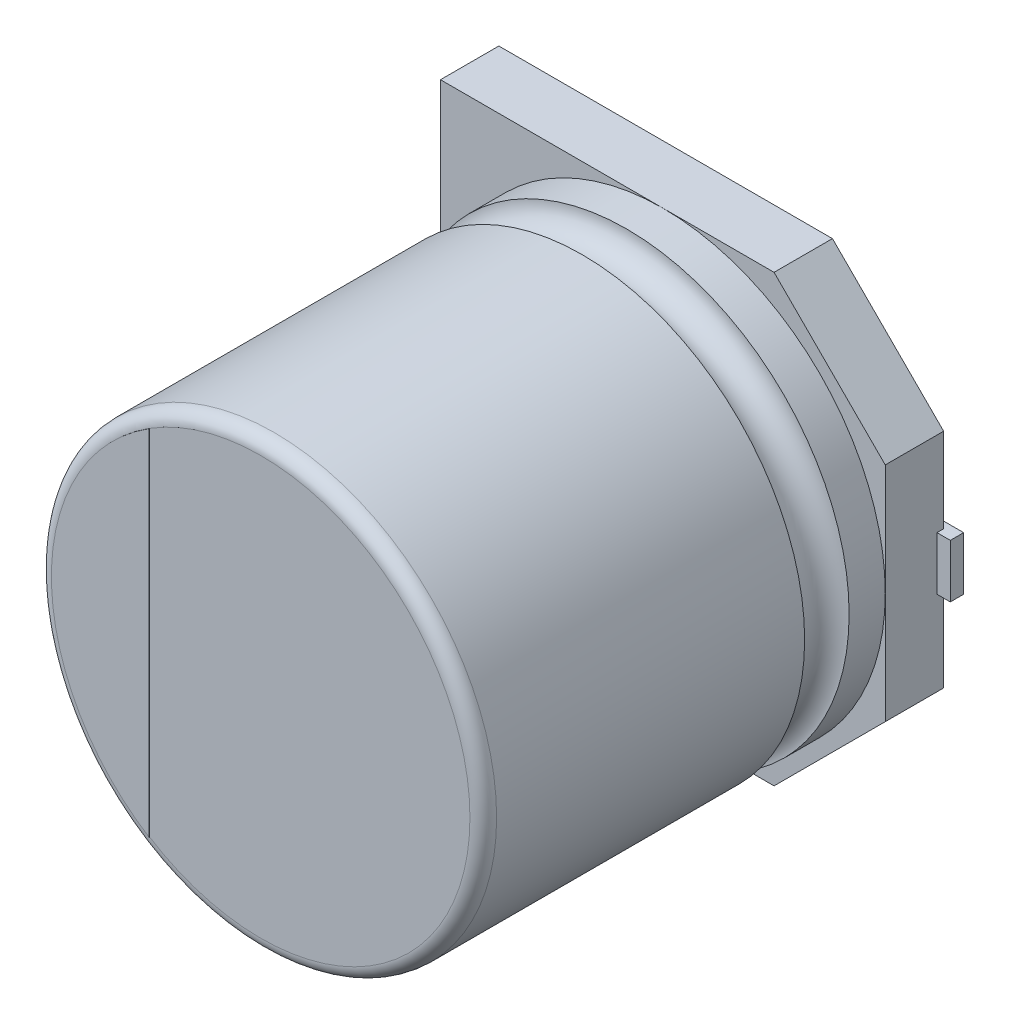
ISO-10303-21;
HEADER;
FILE_DESCRIPTION(('STEP AP214'),'2;1');
FILE_NAME('part.step','',(''),(''),'','','');
FILE_SCHEMA(('AUTOMOTIVE_DESIGN { 1 0 10303 214 1 1 1 1 }'));
ENDSEC;
DATA;
#1=APPLICATION_CONTEXT('core data for automotive mechanical design processes');
#2=APPLICATION_PROTOCOL_DEFINITION('international standard','automotive_design',2000,#1);
#3=PRODUCT_CONTEXT('',#1,'mechanical');
#4=PRODUCT('Part','Part','',(#3));
#5=PRODUCT_RELATED_PRODUCT_CATEGORY('part','',(#4));
#6=PRODUCT_DEFINITION_FORMATION('','',#4);
#7=PRODUCT_DEFINITION_CONTEXT('part definition',#1,'design');
#8=PRODUCT_DEFINITION('design','',#6,#7);
#9=PRODUCT_DEFINITION_SHAPE('','',#8);
#10=(LENGTH_UNIT() NAMED_UNIT(*) SI_UNIT(.MILLI.,.METRE.));
#11=(NAMED_UNIT(*) PLANE_ANGLE_UNIT() SI_UNIT($,.RADIAN.));
#12=(NAMED_UNIT(*) SI_UNIT($,.STERADIAN.) SOLID_ANGLE_UNIT());
#13=UNCERTAINTY_MEASURE_WITH_UNIT(LENGTH_MEASURE(1.E-05),#10,'distance_accuracy_value','');
#14=(GEOMETRIC_REPRESENTATION_CONTEXT(3) GLOBAL_UNCERTAINTY_ASSIGNED_CONTEXT((#13)) GLOBAL_UNIT_ASSIGNED_CONTEXT((#10,
#11,#12)) REPRESENTATION_CONTEXT('',''));
#15=CARTESIAN_POINT('',(0.,0.,0.));
#16=DIRECTION('',(0.,0.,1.));
#17=DIRECTION('',(1.,0.,0.));
#18=AXIS2_PLACEMENT_3D('',#15,#16,#17);
#19=CARTESIAN_POINT('',(5.,2.5,0.15));
#20=DIRECTION('',(0.707106781186548,0.707106781186547,0.));
#21=DIRECTION('',(0.,0.,-1.));
#22=AXIS2_PLACEMENT_3D('',#19,#20,#21);
#23=PLANE('',#22);
#24=DIRECTION('',(0.707106781186547,-0.707106781186548,0.));
#25=VECTOR('',#24,1.);
#26=CARTESIAN_POINT('',(2.5,5.,0.149999999999998));
#27=LINE('',#26,#25);
#28=CARTESIAN_POINT('',(2.5,5.,0.149999999999998));
#29=VERTEX_POINT('',#28);
#30=CARTESIAN_POINT('',(5.,2.5,0.15));
#31=VERTEX_POINT('',#30);
#32=EDGE_CURVE('E441',#29,#31,#27,.T.);
#33=ORIENTED_EDGE('',*,*,#32,.F.);
#34=DIRECTION('',(0.,0.,1.));
#35=VECTOR('',#34,1.);
#36=CARTESIAN_POINT('',(2.5,5.,0.149999999999998));
#37=LINE('',#36,#35);
#38=CARTESIAN_POINT('',(2.5,5.,1.4625));
#39=VERTEX_POINT('',#38);
#40=EDGE_CURVE('E11',#29,#39,#37,.T.);
#41=ORIENTED_EDGE('',*,*,#40,.T.);
#42=DIRECTION('',(-0.707106781186547,0.707106781186548,0.));
#43=VECTOR('',#42,1.);
#44=CARTESIAN_POINT('',(2.5,5.,1.4625));
#45=LINE('',#44,#43);
#46=CARTESIAN_POINT('',(5.,2.5,1.4625));
#47=VERTEX_POINT('',#46);
#48=EDGE_CURVE('E385',#47,#39,#45,.T.);
#49=ORIENTED_EDGE('',*,*,#48,.F.);
#50=DIRECTION('',(0.,0.,1.));
#51=VECTOR('',#50,1.);
#52=CARTESIAN_POINT('',(5.,2.5,0.15));
#53=LINE('',#52,#51);
#54=EDGE_CURVE('E174',#31,#47,#53,.T.);
#55=ORIENTED_EDGE('',*,*,#54,.F.);
#56=EDGE_LOOP('',(#33,#41,#49,#55));
#57=FACE_BOUND('',#56,.T.);
#58=ADVANCED_FACE('F16',(#57),#23,.T.);
#59=CARTESIAN_POINT('',(2.5,5.,0.149999999999998));
#60=DIRECTION('',(0.,1.,0.));
#61=DIRECTION('',(1.,0.,0.));
#62=AXIS2_PLACEMENT_3D('',#59,#60,#61);
#63=PLANE('',#62);
#64=DIRECTION('',(1.,0.,0.));
#65=VECTOR('',#64,1.);
#66=CARTESIAN_POINT('',(-5.,5.,0.149999999999996));
#67=LINE('',#66,#65);
#68=CARTESIAN_POINT('',(-5.,5.,0.149999999999996));
#69=VERTEX_POINT('',#68);
#70=EDGE_CURVE('E446',#69,#29,#67,.T.);
#71=ORIENTED_EDGE('',*,*,#70,.F.);
#72=DIRECTION('',(0.,0.,1.));
#73=VECTOR('',#72,1.);
#74=CARTESIAN_POINT('',(-5.,5.,0.149999999999996));
#75=LINE('',#74,#73);
#76=CARTESIAN_POINT('',(-5.,5.,1.4625));
#77=VERTEX_POINT('',#76);
#78=EDGE_CURVE('E352',#69,#77,#75,.T.);
#79=ORIENTED_EDGE('',*,*,#78,.T.);
#80=DIRECTION('',(-1.,0.,0.));
#81=VECTOR('',#80,1.);
#82=CARTESIAN_POINT('',(-5.,5.,1.4625));
#83=LINE('',#82,#81);
#84=CARTESIAN_POINT('',(0.,5.,1.4625));
#85=VERTEX_POINT('',#84);
#86=EDGE_CURVE('E476',#85,#77,#83,.T.);
#87=ORIENTED_EDGE('',*,*,#86,.F.);
#88=DIRECTION('',(-1.,0.,0.));
#89=VECTOR('',#88,1.);
#90=CARTESIAN_POINT('',(-5.,5.,1.4625));
#91=LINE('',#90,#89);
#92=EDGE_CURVE('E389',#39,#85,#91,.T.);
#93=ORIENTED_EDGE('',*,*,#92,.F.);
#94=ORIENTED_EDGE('',*,*,#40,.F.);
#95=EDGE_LOOP('',(#71,#79,#87,#93,#94));
#96=FACE_BOUND('',#95,.T.);
#97=ADVANCED_FACE('F832',(#96),#63,.T.);
#98=CARTESIAN_POINT('',(-5.,-5.,0.15));
#99=DIRECTION('',(0.,-1.,0.));
#100=DIRECTION('',(-1.,0.,0.));
#101=AXIS2_PLACEMENT_3D('',#98,#99,#100);
#102=PLANE('',#101);
#103=DIRECTION('',(-1.,0.,0.));
#104=VECTOR('',#103,1.);
#105=CARTESIAN_POINT('',(2.5,-5.,0.15));
#106=LINE('',#105,#104);
#107=CARTESIAN_POINT('',(2.5,-5.,0.15));
#108=VERTEX_POINT('',#107);
#109=CARTESIAN_POINT('',(-5.,-5.,0.15));
#110=VERTEX_POINT('',#109);
#111=EDGE_CURVE('E69',#108,#110,#106,.T.);
#112=ORIENTED_EDGE('',*,*,#111,.F.);
#113=DIRECTION('',(0.,0.,1.));
#114=VECTOR('',#113,1.);
#115=CARTESIAN_POINT('',(2.5,-5.,0.15));
#116=LINE('',#115,#114);
#117=CARTESIAN_POINT('',(2.5,-5.,1.4625));
#118=VERTEX_POINT('',#117);
#119=EDGE_CURVE('E27',#108,#118,#116,.T.);
#120=ORIENTED_EDGE('',*,*,#119,.T.);
#121=DIRECTION('',(1.,0.,0.));
#122=VECTOR('',#121,1.);
#123=CARTESIAN_POINT('',(2.5,-5.,1.4625));
#124=LINE('',#123,#122);
#125=CARTESIAN_POINT('',(0.,-5.,1.4625));
#126=VERTEX_POINT('',#125);
#127=EDGE_CURVE('E364',#126,#118,#124,.T.);
#128=ORIENTED_EDGE('',*,*,#127,.F.);
#129=DIRECTION('',(1.,0.,0.));
#130=VECTOR('',#129,1.);
#131=CARTESIAN_POINT('',(2.5,-5.,1.4625));
#132=LINE('',#131,#130);
#133=CARTESIAN_POINT('',(-5.,-5.,1.4625));
#134=VERTEX_POINT('',#133);
#135=EDGE_CURVE('E396',#134,#126,#132,.T.);
#136=ORIENTED_EDGE('',*,*,#135,.F.);
#137=DIRECTION('',(0.,0.,1.));
#138=VECTOR('',#137,1.);
#139=CARTESIAN_POINT('',(-5.,-5.,0.15));
#140=LINE('',#139,#138);
#141=EDGE_CURVE('E356',#110,#134,#140,.T.);
#142=ORIENTED_EDGE('',*,*,#141,.F.);
#143=EDGE_LOOP('',(#112,#120,#128,#136,#142));
#144=FACE_BOUND('',#143,.T.);
#145=ADVANCED_FACE('F824',(#144),#102,.T.);
#146=CARTESIAN_POINT('',(2.5,-5.,0.15));
#147=DIRECTION('',(0.707106781186547,-0.707106781186548,0.));
#148=DIRECTION('',(0.,0.,-1.));
#149=AXIS2_PLACEMENT_3D('',#146,#147,#148);
#150=PLANE('',#149);
#151=DIRECTION('',(-0.707106781186548,-0.707106781186547,0.));
#152=VECTOR('',#151,1.);
#153=CARTESIAN_POINT('',(5.,-2.5,0.15));
#154=LINE('',#153,#152);
#155=CARTESIAN_POINT('',(5.,-2.5,0.15));
#156=VERTEX_POINT('',#155);
#157=EDGE_CURVE('E469',#156,#108,#154,.T.);
#158=ORIENTED_EDGE('',*,*,#157,.F.);
#159=DIRECTION('',(0.,0.,1.));
#160=VECTOR('',#159,1.);
#161=CARTESIAN_POINT('',(5.,-2.5,0.15));
#162=LINE('',#161,#160);
#163=CARTESIAN_POINT('',(5.,-2.5,1.4625));
#164=VERTEX_POINT('',#163);
#165=EDGE_CURVE('E20',#156,#164,#162,.T.);
#166=ORIENTED_EDGE('',*,*,#165,.T.);
#167=DIRECTION('',(0.707106781186548,0.707106781186547,0.));
#168=VECTOR('',#167,1.);
#169=CARTESIAN_POINT('',(5.,-2.5,1.4625));
#170=LINE('',#169,#168);
#171=EDGE_CURVE('E330',#118,#164,#170,.T.);
#172=ORIENTED_EDGE('',*,*,#171,.F.);
#173=ORIENTED_EDGE('',*,*,#119,.F.);
#174=EDGE_LOOP('',(#158,#166,#172,#173));
#175=FACE_BOUND('',#174,.T.);
#176=ADVANCED_FACE('F819',(#175),#150,.T.);
#177=CARTESIAN_POINT('',(5.,-2.5,0.15));
#178=DIRECTION('',(1.,0.,0.));
#179=DIRECTION('',(0.,-1.,0.));
#180=AXIS2_PLACEMENT_3D('',#177,#178,#179);
#181=PLANE('',#180);
#182=DIRECTION('',(0.,0.,-1.));
#183=VECTOR('',#182,1.);
#184=CARTESIAN_POINT('',(5.,0.6,0.225));
#185=LINE('',#184,#183);
#186=CARTESIAN_POINT('',(5.,0.6,0.3));
#187=VERTEX_POINT('',#186);
#188=CARTESIAN_POINT('',(5.,0.6,0.15));
#189=VERTEX_POINT('',#188);
#190=EDGE_CURVE('E404',#187,#189,#185,.T.);
#191=ORIENTED_EDGE('',*,*,#190,.T.);
#192=DIRECTION('',(0.,-1.,0.));
#193=VECTOR('',#192,1.);
#194=CARTESIAN_POINT('',(5.,0.,0.15));
#195=LINE('',#194,#193);
#196=EDGE_CURVE('E445',#31,#189,#195,.T.);
#197=ORIENTED_EDGE('',*,*,#196,.F.);
#198=ORIENTED_EDGE('',*,*,#54,.T.);
#199=DIRECTION('',(0.,1.,0.));
#200=VECTOR('',#199,1.);
#201=CARTESIAN_POINT('',(5.,0.,1.4625));
#202=LINE('',#201,#200);
#203=CARTESIAN_POINT('',(5.,0.,1.4625));
#204=VERTEX_POINT('',#203);
#205=EDGE_CURVE('E390',#204,#47,#202,.T.);
#206=ORIENTED_EDGE('',*,*,#205,.F.);
#207=DIRECTION('',(0.,1.,0.));
#208=VECTOR('',#207,1.);
#209=CARTESIAN_POINT('',(5.,0.,1.4625));
#210=LINE('',#209,#208);
#211=EDGE_CURVE('E325',#164,#204,#210,.T.);
#212=ORIENTED_EDGE('',*,*,#211,.F.);
#213=ORIENTED_EDGE('',*,*,#165,.F.);
#214=DIRECTION('',(0.,-1.,0.));
#215=VECTOR('',#214,1.);
#216=CARTESIAN_POINT('',(5.,0.,0.15));
#217=LINE('',#216,#215);
#218=CARTESIAN_POINT('',(5.,-0.6,0.15));
#219=VERTEX_POINT('',#218);
#220=EDGE_CURVE('E472',#219,#156,#217,.T.);
#221=ORIENTED_EDGE('',*,*,#220,.F.);
#222=DIRECTION('',(0.,0.,1.));
#223=VECTOR('',#222,1.);
#224=CARTESIAN_POINT('',(5.,-0.6,0.225));
#225=LINE('',#224,#223);
#226=CARTESIAN_POINT('',(5.,-0.6,0.3));
#227=VERTEX_POINT('',#226);
#228=EDGE_CURVE('E419',#219,#227,#225,.T.);
#229=ORIENTED_EDGE('',*,*,#228,.T.);
#230=DIRECTION('',(0.,1.,0.));
#231=VECTOR('',#230,1.);
#232=CARTESIAN_POINT('',(5.,-1.55,0.3));
#233=LINE('',#232,#231);
#234=EDGE_CURVE('E321',#227,#187,#233,.T.);
#235=ORIENTED_EDGE('',*,*,#234,.T.);
#236=EDGE_LOOP('',(#191,#197,#198,#206,#212,#213,#221,#229,#235));
#237=FACE_BOUND('',#236,.T.);
#238=ADVANCED_FACE('F823',(#237),#181,.T.);
#239=CARTESIAN_POINT('',(5.,2.5,0.15));
#240=DIRECTION('',(0.,0.,-1.));
#241=DIRECTION('',(0.,-1.,0.));
#242=AXIS2_PLACEMENT_3D('',#239,#240,#241);
#243=PLANE('',#242);
#244=DIRECTION('',(-1.,0.,0.));
#245=VECTOR('',#244,1.);
#246=CARTESIAN_POINT('',(-0.15,0.6,0.15));
#247=LINE('',#246,#245);
#248=CARTESIAN_POINT('',(-2.,0.6,0.149999999999998));
#249=VERTEX_POINT('',#248);
#250=CARTESIAN_POINT('',(-5.,0.6,0.149999999999997));
#251=VERTEX_POINT('',#250);
#252=EDGE_CURVE('E379',#249,#251,#247,.T.);
#253=ORIENTED_EDGE('',*,*,#252,.T.);
#254=DIRECTION('',(0.,1.,0.));
#255=VECTOR('',#254,1.);
#256=CARTESIAN_POINT('',(-5.,-5.,0.15));
#257=LINE('',#256,#255);
#258=EDGE_CURVE('E355',#251,#69,#257,.T.);
#259=ORIENTED_EDGE('',*,*,#258,.T.);
#260=ORIENTED_EDGE('',*,*,#70,.T.);
#261=ORIENTED_EDGE('',*,*,#32,.T.);
#262=ORIENTED_EDGE('',*,*,#196,.T.);
#263=DIRECTION('',(-1.,0.,0.));
#264=VECTOR('',#263,1.);
#265=CARTESIAN_POINT('',(3.5,0.6,0.15));
#266=LINE('',#265,#264);
#267=CARTESIAN_POINT('',(2.,0.6,0.15));
#268=VERTEX_POINT('',#267);
#269=EDGE_CURVE('E485',#189,#268,#266,.T.);
#270=ORIENTED_EDGE('',*,*,#269,.T.);
#271=DIRECTION('',(0.,-1.,0.));
#272=VECTOR('',#271,1.);
#273=CARTESIAN_POINT('',(2.,0.95,0.15));
#274=LINE('',#273,#272);
#275=CARTESIAN_POINT('',(2.,-0.6,0.15));
#276=VERTEX_POINT('',#275);
#277=EDGE_CURVE('E314',#268,#276,#274,.T.);
#278=ORIENTED_EDGE('',*,*,#277,.T.);
#279=DIRECTION('',(1.,0.,0.));
#280=VECTOR('',#279,1.);
#281=CARTESIAN_POINT('',(5.15,-0.6,0.15));
#282=LINE('',#281,#280);
#283=EDGE_CURVE('E336',#276,#219,#282,.T.);
#284=ORIENTED_EDGE('',*,*,#283,.T.);
#285=ORIENTED_EDGE('',*,*,#220,.T.);
#286=ORIENTED_EDGE('',*,*,#157,.T.);
#287=ORIENTED_EDGE('',*,*,#111,.T.);
#288=DIRECTION('',(0.,1.,0.));
#289=VECTOR('',#288,1.);
#290=CARTESIAN_POINT('',(-5.,-5.,0.15));
#291=LINE('',#290,#289);
#292=CARTESIAN_POINT('',(-5.,-0.6,0.149999999999998));
#293=VERTEX_POINT('',#292);
#294=EDGE_CURVE('E82',#110,#293,#291,.T.);
#295=ORIENTED_EDGE('',*,*,#294,.T.);
#296=DIRECTION('',(1.,0.,0.));
#297=VECTOR('',#296,1.);
#298=CARTESIAN_POINT('',(1.5,-0.6,0.15));
#299=LINE('',#298,#297);
#300=CARTESIAN_POINT('',(-2.,-0.6,0.149999999999998));
#301=VERTEX_POINT('',#300);
#302=EDGE_CURVE('E324',#293,#301,#299,.T.);
#303=ORIENTED_EDGE('',*,*,#302,.T.);
#304=DIRECTION('',(0.,1.,0.));
#305=VECTOR('',#304,1.);
#306=CARTESIAN_POINT('',(-2.,1.55,0.149999999999998));
#307=LINE('',#306,#305);
#308=EDGE_CURVE('E331',#301,#249,#307,.T.);
#309=ORIENTED_EDGE('',*,*,#308,.T.);
#310=EDGE_LOOP('',(#253,#259,#260,#261,#262,#270,#278,#284,#285,#286,#287,#295,#303,#309));
#311=FACE_BOUND('',#310,.T.);
#312=ADVANCED_FACE('F928',(#311),#243,.T.);
#313=CARTESIAN_POINT('',(2.,-0.6,0.));
#314=DIRECTION('',(0.,0.,-1.));
#315=DIRECTION('',(0.,-1.,0.));
#316=AXIS2_PLACEMENT_3D('',#313,#314,#315);
#317=PLANE('',#316);
#318=DIRECTION('',(-1.,0.,0.));
#319=VECTOR('',#318,1.);
#320=CARTESIAN_POINT('',(5.3,-0.6,0.));
#321=LINE('',#320,#319);
#322=CARTESIAN_POINT('',(5.3,-0.6,0.));
#323=VERTEX_POINT('',#322);
#324=CARTESIAN_POINT('',(2.,-0.6,0.));
#325=VERTEX_POINT('',#324);
#326=EDGE_CURVE('E340',#323,#325,#321,.T.);
#327=ORIENTED_EDGE('',*,*,#326,.T.);
#328=DIRECTION('',(0.,1.,0.));
#329=VECTOR('',#328,1.);
#330=CARTESIAN_POINT('',(2.,-0.6,0.));
#331=LINE('',#330,#329);
#332=CARTESIAN_POINT('',(2.,0.6,0.));
#333=VERTEX_POINT('',#332);
#334=EDGE_CURVE('E228',#325,#333,#331,.T.);
#335=ORIENTED_EDGE('',*,*,#334,.T.);
#336=DIRECTION('',(1.,0.,0.));
#337=VECTOR('',#336,1.);
#338=CARTESIAN_POINT('',(2.,0.6,0.));
#339=LINE('',#338,#337);
#340=CARTESIAN_POINT('',(5.3,0.6,0.));
#341=VERTEX_POINT('',#340);
#342=EDGE_CURVE('E350',#333,#341,#339,.T.);
#343=ORIENTED_EDGE('',*,*,#342,.T.);
#344=DIRECTION('',(0.,-1.,0.));
#345=VECTOR('',#344,1.);
#346=CARTESIAN_POINT('',(5.3,0.6,0.));
#347=LINE('',#346,#345);
#348=EDGE_CURVE('E241',#341,#323,#347,.T.);
#349=ORIENTED_EDGE('',*,*,#348,.T.);
#350=EDGE_LOOP('',(#327,#335,#343,#349));
#351=FACE_BOUND('',#350,.T.);
#352=ADVANCED_FACE('F860',(#351),#317,.T.);
#353=CARTESIAN_POINT('',(5.3,-0.6,0.3));
#354=DIRECTION('',(0.,-1.,0.));
#355=DIRECTION('',(-1.,0.,0.));
#356=AXIS2_PLACEMENT_3D('',#353,#354,#355);
#357=PLANE('',#356);
#358=ORIENTED_EDGE('',*,*,#283,.F.);
#359=DIRECTION('',(0.,0.,-1.));
#360=VECTOR('',#359,1.);
#361=CARTESIAN_POINT('',(2.,-0.6,0.3));
#362=LINE('',#361,#360);
#363=EDGE_CURVE('E341',#276,#325,#362,.T.);
#364=ORIENTED_EDGE('',*,*,#363,.T.);
#365=ORIENTED_EDGE('',*,*,#326,.F.);
#366=DIRECTION('',(0.,0.,-1.));
#367=VECTOR('',#366,1.);
#368=CARTESIAN_POINT('',(5.3,-0.6,0.3));
#369=LINE('',#368,#367);
#370=CARTESIAN_POINT('',(5.3,-0.6,0.3));
#371=VERTEX_POINT('',#370);
#372=EDGE_CURVE('E315',#371,#323,#369,.T.);
#373=ORIENTED_EDGE('',*,*,#372,.F.);
#374=DIRECTION('',(-1.,0.,0.));
#375=VECTOR('',#374,1.);
#376=CARTESIAN_POINT('',(5.3,-0.6,0.3));
#377=LINE('',#376,#375);
#378=EDGE_CURVE('E316',#371,#227,#377,.T.);
#379=ORIENTED_EDGE('',*,*,#378,.T.);
#380=ORIENTED_EDGE('',*,*,#228,.F.);
#381=EDGE_LOOP('',(#358,#364,#365,#373,#379,#380));
#382=FACE_BOUND('',#381,.T.);
#383=ADVANCED_FACE('F855',(#382),#357,.T.);
#384=CARTESIAN_POINT('',(2.,-0.6,0.3));
#385=DIRECTION('',(-1.,0.,0.));
#386=DIRECTION('',(0.,0.,1.));
#387=AXIS2_PLACEMENT_3D('',#384,#385,#386);
#388=PLANE('',#387);
#389=ORIENTED_EDGE('',*,*,#277,.F.);
#390=DIRECTION('',(0.,0.,-1.));
#391=VECTOR('',#390,1.);
#392=CARTESIAN_POINT('',(2.,0.6,0.3));
#393=LINE('',#392,#391);
#394=EDGE_CURVE('E409',#268,#333,#393,.T.);
#395=ORIENTED_EDGE('',*,*,#394,.T.);
#396=ORIENTED_EDGE('',*,*,#334,.F.);
#397=ORIENTED_EDGE('',*,*,#363,.F.);
#398=EDGE_LOOP('',(#389,#395,#396,#397));
#399=FACE_BOUND('',#398,.T.);
#400=ADVANCED_FACE('F859',(#399),#388,.T.);
#401=CARTESIAN_POINT('',(5.3,0.6,0.3));
#402=DIRECTION('',(1.,0.,0.));
#403=DIRECTION('',(0.,-1.,0.));
#404=AXIS2_PLACEMENT_3D('',#401,#402,#403);
#405=PLANE('',#404);
#406=DIRECTION('',(0.,-1.,0.));
#407=VECTOR('',#406,1.);
#408=CARTESIAN_POINT('',(5.3,0.6,0.3));
#409=LINE('',#408,#407);
#410=CARTESIAN_POINT('',(5.3,0.6,0.3));
#411=VERTEX_POINT('',#410);
#412=EDGE_CURVE('E320',#411,#371,#409,.T.);
#413=ORIENTED_EDGE('',*,*,#412,.T.);
#414=ORIENTED_EDGE('',*,*,#372,.T.);
#415=ORIENTED_EDGE('',*,*,#348,.F.);
#416=DIRECTION('',(0.,0.,-1.));
#417=VECTOR('',#416,1.);
#418=CARTESIAN_POINT('',(5.3,0.6,0.3));
#419=LINE('',#418,#417);
#420=EDGE_CURVE('E346',#411,#341,#419,.T.);
#421=ORIENTED_EDGE('',*,*,#420,.F.);
#422=EDGE_LOOP('',(#413,#414,#415,#421));
#423=FACE_BOUND('',#422,.T.);
#424=ADVANCED_FACE('F866',(#423),#405,.T.);
#425=CARTESIAN_POINT('',(2.,-0.6,0.3));
#426=DIRECTION('',(0.,0.,1.));
#427=DIRECTION('',(1.,0.,0.));
#428=AXIS2_PLACEMENT_3D('',#425,#426,#427);
#429=PLANE('',#428);
#430=ORIENTED_EDGE('',*,*,#234,.F.);
#431=ORIENTED_EDGE('',*,*,#378,.F.);
#432=ORIENTED_EDGE('',*,*,#412,.F.);
#433=DIRECTION('',(1.,0.,0.));
#434=VECTOR('',#433,1.);
#435=CARTESIAN_POINT('',(2.,0.6,0.3));
#436=LINE('',#435,#434);
#437=EDGE_CURVE('E351',#187,#411,#436,.T.);
#438=ORIENTED_EDGE('',*,*,#437,.F.);
#439=EDGE_LOOP('',(#430,#431,#432,#438));
#440=FACE_BOUND('',#439,.T.);
#441=ADVANCED_FACE('F870',(#440),#429,.T.);
#442=CARTESIAN_POINT('',(2.,0.6,0.3));
#443=DIRECTION('',(0.,1.,0.));
#444=DIRECTION('',(1.,0.,0.));
#445=AXIS2_PLACEMENT_3D('',#442,#443,#444);
#446=PLANE('',#445);
#447=ORIENTED_EDGE('',*,*,#269,.F.);
#448=ORIENTED_EDGE('',*,*,#190,.F.);
#449=ORIENTED_EDGE('',*,*,#437,.T.);
#450=ORIENTED_EDGE('',*,*,#420,.T.);
#451=ORIENTED_EDGE('',*,*,#342,.F.);
#452=ORIENTED_EDGE('',*,*,#394,.F.);
#453=EDGE_LOOP('',(#447,#448,#449,#450,#451,#452));
#454=FACE_BOUND('',#453,.T.);
#455=ADVANCED_FACE('F887',(#454),#446,.T.);
#456=CARTESIAN_POINT('',(-5.,5.,0.149999999999996));
#457=DIRECTION('',(-1.,0.,0.));
#458=DIRECTION('',(0.,0.,1.));
#459=AXIS2_PLACEMENT_3D('',#456,#457,#458);
#460=PLANE('',#459);
#461=DIRECTION('',(0.,0.,1.));
#462=VECTOR('',#461,1.);
#463=CARTESIAN_POINT('',(-5.,0.6,0.224999999999997));
#464=LINE('',#463,#462);
#465=CARTESIAN_POINT('',(-5.,0.6,0.3));
#466=VERTEX_POINT('',#465);
#467=EDGE_CURVE('E384',#251,#466,#464,.T.);
#468=ORIENTED_EDGE('',*,*,#467,.T.);
#469=DIRECTION('',(0.,-1.,0.));
#470=VECTOR('',#469,1.);
#471=CARTESIAN_POINT('',(-5.,2.2,0.3));
#472=LINE('',#471,#470);
#473=CARTESIAN_POINT('',(-5.,-0.6,0.3));
#474=VERTEX_POINT('',#473);
#475=EDGE_CURVE('E373',#466,#474,#472,.T.);
#476=ORIENTED_EDGE('',*,*,#475,.T.);
#477=DIRECTION('',(0.,0.,-1.));
#478=VECTOR('',#477,1.);
#479=CARTESIAN_POINT('',(-5.,-0.6,0.225));
#480=LINE('',#479,#478);
#481=EDGE_CURVE('E495',#474,#293,#480,.T.);
#482=ORIENTED_EDGE('',*,*,#481,.T.);
#483=ORIENTED_EDGE('',*,*,#294,.F.);
#484=ORIENTED_EDGE('',*,*,#141,.T.);
#485=DIRECTION('',(0.,-1.,0.));
#486=VECTOR('',#485,1.);
#487=CARTESIAN_POINT('',(-5.,-5.,1.4625));
#488=LINE('',#487,#486);
#489=CARTESIAN_POINT('',(-5.,0.,1.4625));
#490=VERTEX_POINT('',#489);
#491=EDGE_CURVE('E329',#490,#134,#488,.T.);
#492=ORIENTED_EDGE('',*,*,#491,.F.);
#493=DIRECTION('',(0.,-1.,0.));
#494=VECTOR('',#493,1.);
#495=CARTESIAN_POINT('',(-5.,-5.,1.4625));
#496=LINE('',#495,#494);
#497=EDGE_CURVE('E437',#77,#490,#496,.T.);
#498=ORIENTED_EDGE('',*,*,#497,.F.);
#499=ORIENTED_EDGE('',*,*,#78,.F.);
#500=ORIENTED_EDGE('',*,*,#258,.F.);
#501=EDGE_LOOP('',(#468,#476,#482,#483,#484,#492,#498,#499,#500));
#502=FACE_BOUND('',#501,.T.);
#503=ADVANCED_FACE('F909',(#502),#460,.T.);
#504=CARTESIAN_POINT('',(-2.,-0.6,0.));
#505=DIRECTION('',(0.,0.,-1.));
#506=DIRECTION('',(0.,-1.,0.));
#507=AXIS2_PLACEMENT_3D('',#504,#505,#506);
#508=PLANE('',#507);
#509=DIRECTION('',(0.,-1.,0.));
#510=VECTOR('',#509,1.);
#511=CARTESIAN_POINT('',(-2.,0.6,0.));
#512=LINE('',#511,#510);
#513=CARTESIAN_POINT('',(-2.,0.6,0.));
#514=VERTEX_POINT('',#513);
#515=CARTESIAN_POINT('',(-2.,-0.6,0.));
#516=VERTEX_POINT('',#515);
#517=EDGE_CURVE('E311',#514,#516,#512,.T.);
#518=ORIENTED_EDGE('',*,*,#517,.T.);
#519=DIRECTION('',(-1.,0.,0.));
#520=VECTOR('',#519,1.);
#521=CARTESIAN_POINT('',(-2.,-0.6,0.));
#522=LINE('',#521,#520);
#523=CARTESIAN_POINT('',(-5.3,-0.6,0.));
#524=VERTEX_POINT('',#523);
#525=EDGE_CURVE('E135',#516,#524,#522,.T.);
#526=ORIENTED_EDGE('',*,*,#525,.T.);
#527=DIRECTION('',(0.,1.,0.));
#528=VECTOR('',#527,1.);
#529=CARTESIAN_POINT('',(-5.3,-0.6,0.));
#530=LINE('',#529,#528);
#531=CARTESIAN_POINT('',(-5.3,0.6,0.));
#532=VERTEX_POINT('',#531);
#533=EDGE_CURVE('E310',#524,#532,#530,.T.);
#534=ORIENTED_EDGE('',*,*,#533,.T.);
#535=DIRECTION('',(1.,0.,0.));
#536=VECTOR('',#535,1.);
#537=CARTESIAN_POINT('',(-5.3,0.6,0.));
#538=LINE('',#537,#536);
#539=EDGE_CURVE('E423',#532,#514,#538,.T.);
#540=ORIENTED_EDGE('',*,*,#539,.T.);
#541=EDGE_LOOP('',(#518,#526,#534,#540));
#542=FACE_BOUND('',#541,.T.);
#543=ADVANCED_FACE('F538',(#542),#508,.T.);
#544=CARTESIAN_POINT('',(-2.,-0.6,0.3));
#545=DIRECTION('',(0.,0.,1.));
#546=DIRECTION('',(1.,0.,0.));
#547=AXIS2_PLACEMENT_3D('',#544,#545,#546);
#548=PLANE('',#547);
#549=ORIENTED_EDGE('',*,*,#475,.F.);
#550=DIRECTION('',(1.,0.,0.));
#551=VECTOR('',#550,1.);
#552=CARTESIAN_POINT('',(-5.3,0.6,0.3));
#553=LINE('',#552,#551);
#554=CARTESIAN_POINT('',(-5.3,0.6,0.3));
#555=VERTEX_POINT('',#554);
#556=EDGE_CURVE('E335',#555,#466,#553,.T.);
#557=ORIENTED_EDGE('',*,*,#556,.F.);
#558=DIRECTION('',(0.,1.,0.));
#559=VECTOR('',#558,1.);
#560=CARTESIAN_POINT('',(-5.3,-0.6,0.3));
#561=LINE('',#560,#559);
#562=CARTESIAN_POINT('',(-5.3,-0.6,0.3));
#563=VERTEX_POINT('',#562);
#564=EDGE_CURVE('E307',#563,#555,#561,.T.);
#565=ORIENTED_EDGE('',*,*,#564,.F.);
#566=DIRECTION('',(-1.,0.,0.));
#567=VECTOR('',#566,1.);
#568=CARTESIAN_POINT('',(-2.,-0.6,0.3));
#569=LINE('',#568,#567);
#570=EDGE_CURVE('E146',#474,#563,#569,.T.);
#571=ORIENTED_EDGE('',*,*,#570,.F.);
#572=EDGE_LOOP('',(#549,#557,#565,#571));
#573=FACE_BOUND('',#572,.T.);
#574=ADVANCED_FACE('F18',(#573),#548,.T.);
#575=CARTESIAN_POINT('',(-2.,-0.6,0.3));
#576=DIRECTION('',(0.,-1.,0.));
#577=DIRECTION('',(-1.,0.,0.));
#578=AXIS2_PLACEMENT_3D('',#575,#576,#577);
#579=PLANE('',#578);
#580=ORIENTED_EDGE('',*,*,#481,.F.);
#581=ORIENTED_EDGE('',*,*,#570,.T.);
#582=DIRECTION('',(0.,0.,-1.));
#583=VECTOR('',#582,1.);
#584=CARTESIAN_POINT('',(-5.3,-0.6,0.3));
#585=LINE('',#584,#583);
#586=EDGE_CURVE('E503',#563,#524,#585,.T.);
#587=ORIENTED_EDGE('',*,*,#586,.T.);
#588=ORIENTED_EDGE('',*,*,#525,.F.);
#589=DIRECTION('',(0.,0.,-1.));
#590=VECTOR('',#589,1.);
#591=CARTESIAN_POINT('',(-2.,-0.6,0.3));
#592=LINE('',#591,#590);
#593=EDGE_CURVE('E334',#301,#516,#592,.T.);
#594=ORIENTED_EDGE('',*,*,#593,.F.);
#595=ORIENTED_EDGE('',*,*,#302,.F.);
#596=EDGE_LOOP('',(#580,#581,#587,#588,#594,#595));
#597=FACE_BOUND('',#596,.T.);
#598=ADVANCED_FACE('F807',(#597),#579,.T.);
#599=CARTESIAN_POINT('',(-5.3,-0.6,0.3));
#600=DIRECTION('',(-1.,0.,0.));
#601=DIRECTION('',(0.,0.,1.));
#602=AXIS2_PLACEMENT_3D('',#599,#600,#601);
#603=PLANE('',#602);
#604=ORIENTED_EDGE('',*,*,#564,.T.);
#605=DIRECTION('',(0.,0.,-1.));
#606=VECTOR('',#605,1.);
#607=CARTESIAN_POINT('',(-5.3,0.6,0.3));
#608=LINE('',#607,#606);
#609=EDGE_CURVE('E447',#555,#532,#608,.T.);
#610=ORIENTED_EDGE('',*,*,#609,.T.);
#611=ORIENTED_EDGE('',*,*,#533,.F.);
#612=ORIENTED_EDGE('',*,*,#586,.F.);
#613=EDGE_LOOP('',(#604,#610,#611,#612));
#614=FACE_BOUND('',#613,.T.);
#615=ADVANCED_FACE('F543',(#614),#603,.T.);
#616=CARTESIAN_POINT('',(-2.,0.6,0.3));
#617=DIRECTION('',(1.,0.,0.));
#618=DIRECTION('',(0.,-1.,0.));
#619=AXIS2_PLACEMENT_3D('',#616,#617,#618);
#620=PLANE('',#619);
#621=ORIENTED_EDGE('',*,*,#308,.F.);
#622=ORIENTED_EDGE('',*,*,#593,.T.);
#623=ORIENTED_EDGE('',*,*,#517,.F.);
#624=DIRECTION('',(0.,0.,-1.));
#625=VECTOR('',#624,1.);
#626=CARTESIAN_POINT('',(-2.,0.6,0.3));
#627=LINE('',#626,#625);
#628=EDGE_CURVE('E383',#249,#514,#627,.T.);
#629=ORIENTED_EDGE('',*,*,#628,.F.);
#630=EDGE_LOOP('',(#621,#622,#623,#629));
#631=FACE_BOUND('',#630,.T.);
#632=ADVANCED_FACE('F553',(#631),#620,.T.);
#633=CARTESIAN_POINT('',(-5.3,0.6,0.3));
#634=DIRECTION('',(0.,1.,0.));
#635=DIRECTION('',(1.,0.,0.));
#636=AXIS2_PLACEMENT_3D('',#633,#634,#635);
#637=PLANE('',#636);
#638=ORIENTED_EDGE('',*,*,#467,.F.);
#639=ORIENTED_EDGE('',*,*,#252,.F.);
#640=ORIENTED_EDGE('',*,*,#628,.T.);
#641=ORIENTED_EDGE('',*,*,#539,.F.);
#642=ORIENTED_EDGE('',*,*,#609,.F.);
#643=ORIENTED_EDGE('',*,*,#556,.T.);
#644=EDGE_LOOP('',(#638,#639,#640,#641,#642,#643));
#645=FACE_BOUND('',#644,.T.);
#646=ADVANCED_FACE('F548',(#645),#637,.T.);
#647=CARTESIAN_POINT('',(5.,2.5,1.4625));
#648=DIRECTION('',(0.,0.,1.));
#649=DIRECTION('',(1.,0.,0.));
#650=AXIS2_PLACEMENT_3D('',#647,#648,#649);
#651=PLANE('',#650);
#652=CARTESIAN_POINT('',(0.,0.,1.4625));
#653=DIRECTION('',(0.,0.,-1.));
#654=DIRECTION('',(-1.,0.,0.));
#655=AXIS2_PLACEMENT_3D('',#652,#653,#654);
#656=CIRCLE('',#655,5.);
#657=EDGE_CURVE('E400',#85,#204,#656,.T.);
#658=ORIENTED_EDGE('',*,*,#657,.T.);
#659=ORIENTED_EDGE('',*,*,#205,.T.);
#660=ORIENTED_EDGE('',*,*,#48,.T.);
#661=ORIENTED_EDGE('',*,*,#92,.T.);
#662=EDGE_LOOP('',(#658,#659,#660,#661));
#663=FACE_BOUND('',#662,.T.);
#664=ADVANCED_FACE('F845',(#663),#651,.T.);
#665=CARTESIAN_POINT('',(5.,2.5,1.4625));
#666=DIRECTION('',(0.,0.,1.));
#667=DIRECTION('',(1.,0.,0.));
#668=AXIS2_PLACEMENT_3D('',#665,#666,#667);
#669=PLANE('',#668);
#670=CARTESIAN_POINT('',(0.,0.,1.4625));
#671=DIRECTION('',(0.,0.,-1.));
#672=DIRECTION('',(-1.,0.,0.));
#673=AXIS2_PLACEMENT_3D('',#670,#671,#672);
#674=CIRCLE('',#673,5.);
#675=EDGE_CURVE('E433',#490,#85,#674,.T.);
#676=ORIENTED_EDGE('',*,*,#675,.T.);
#677=ORIENTED_EDGE('',*,*,#86,.T.);
#678=ORIENTED_EDGE('',*,*,#497,.T.);
#679=EDGE_LOOP('',(#676,#677,#678));
#680=FACE_BOUND('',#679,.T.);
#681=ADVANCED_FACE('F849',(#680),#669,.T.);
#682=CARTESIAN_POINT('',(5.,2.5,1.4625));
#683=DIRECTION('',(0.,0.,1.));
#684=DIRECTION('',(1.,0.,0.));
#685=AXIS2_PLACEMENT_3D('',#682,#683,#684);
#686=PLANE('',#685);
#687=CARTESIAN_POINT('',(0.,0.,1.4625));
#688=DIRECTION('',(0.,0.,-1.));
#689=DIRECTION('',(-1.,0.,0.));
#690=AXIS2_PLACEMENT_3D('',#687,#688,#689);
#691=CIRCLE('',#690,5.);
#692=EDGE_CURVE('E455',#126,#490,#691,.T.);
#693=ORIENTED_EDGE('',*,*,#692,.T.);
#694=ORIENTED_EDGE('',*,*,#491,.T.);
#695=ORIENTED_EDGE('',*,*,#135,.T.);
#696=EDGE_LOOP('',(#693,#694,#695));
#697=FACE_BOUND('',#696,.T.);
#698=ADVANCED_FACE('F896',(#697),#686,.T.);
#699=CARTESIAN_POINT('',(5.,2.5,1.4625));
#700=DIRECTION('',(0.,0.,1.));
#701=DIRECTION('',(1.,0.,0.));
#702=AXIS2_PLACEMENT_3D('',#699,#700,#701);
#703=PLANE('',#702);
#704=CARTESIAN_POINT('',(0.,0.,1.4625));
#705=DIRECTION('',(0.,0.,-1.));
#706=DIRECTION('',(-1.,0.,0.));
#707=AXIS2_PLACEMENT_3D('',#704,#705,#706);
#708=CIRCLE('',#707,5.);
#709=EDGE_CURVE('E459',#204,#126,#708,.T.);
#710=ORIENTED_EDGE('',*,*,#709,.T.);
#711=ORIENTED_EDGE('',*,*,#127,.T.);
#712=ORIENTED_EDGE('',*,*,#171,.T.);
#713=ORIENTED_EDGE('',*,*,#211,.T.);
#714=EDGE_LOOP('',(#710,#711,#712,#713));
#715=FACE_BOUND('',#714,.T.);
#716=ADVANCED_FACE('F879',(#715),#703,.T.);
#717=CARTESIAN_POINT('',(0.,0.,5.98125));
#718=DIRECTION('',(0.,0.,1.));
#719=DIRECTION('',(-1.,0.,0.));
#720=AXIS2_PLACEMENT_3D('',#717,#718,#719);
#721=CYLINDRICAL_SURFACE('',#720,5.);
#722=CARTESIAN_POINT('',(0.,0.,2.275));
#723=DIRECTION('',(0.,0.,-1.));
#724=DIRECTION('',(-1.,0.,0.));
#725=AXIS2_PLACEMENT_3D('',#722,#723,#724);
#726=CIRCLE('',#725,5.);
#727=CARTESIAN_POINT('',(5.,0.,2.275));
#728=VERTEX_POINT('',#727);
#729=EDGE_CURVE('E365',#728,#728,#726,.T.);
#730=ORIENTED_EDGE('',*,*,#729,.T.);
#731=DIRECTION('',(0.,0.,-1.));
#732=VECTOR('',#731,1.);
#733=CARTESIAN_POINT('',(5.,0.,5.98125));
#734=LINE('',#733,#732);
#735=EDGE_CURVE('E368',#728,#204,#734,.T.);
#736=ORIENTED_EDGE('',*,*,#735,.T.);
#737=ORIENTED_EDGE('',*,*,#657,.F.);
#738=ORIENTED_EDGE('',*,*,#675,.F.);
#739=ORIENTED_EDGE('',*,*,#692,.F.);
#740=ORIENTED_EDGE('',*,*,#709,.F.);
#741=ORIENTED_EDGE('',*,*,#735,.F.);
#742=EDGE_LOOP('',(#730,#736,#737,#738,#739,#740,#741));
#743=FACE_BOUND('',#742,.T.);
#744=ADVANCED_FACE('F874',(#743),#721,.T.);
#745=CARTESIAN_POINT('',(0.,0.,2.775));
#746=DIRECTION('',(0.,0.,1.));
#747=DIRECTION('',(-1.,0.,0.));
#748=AXIS2_PLACEMENT_3D('',#745,#746,#747);
#749=TOROIDAL_SURFACE('',#748,5.,0.5);
#750=CARTESIAN_POINT('',(0.,0.,3.275));
#751=DIRECTION('',(0.,0.,1.));
#752=DIRECTION('',(-1.,0.,0.));
#753=AXIS2_PLACEMENT_3D('',#750,#751,#752);
#754=CIRCLE('',#753,5.);
#755=CARTESIAN_POINT('',(5.,0.,3.275));
#756=VERTEX_POINT('',#755);
#757=EDGE_CURVE('E345',#756,#756,#754,.T.);
#758=ORIENTED_EDGE('',*,*,#757,.F.);
#759=CARTESIAN_POINT('',(5.,0.,2.775));
#760=DIRECTION('',(0.,-1.,0.));
#761=DIRECTION('',(1.,0.,0.));
#762=AXIS2_PLACEMENT_3D('',#759,#760,#761);
#763=CIRCLE('',#762,0.5);
#764=EDGE_CURVE('E359',#756,#728,#763,.T.);
#765=ORIENTED_EDGE('',*,*,#764,.T.);
#766=ORIENTED_EDGE('',*,*,#729,.F.);
#767=ORIENTED_EDGE('',*,*,#764,.F.);
#768=EDGE_LOOP('',(#758,#765,#766,#767));
#769=FACE_BOUND('',#768,.T.);
#770=ADVANCED_FACE('F878',(#769),#749,.F.);
#771=CARTESIAN_POINT('',(0.,0.,10.5));
#772=DIRECTION('',(0.,0.,1.));
#773=DIRECTION('',(1.,0.,0.));
#774=AXIS2_PLACEMENT_3D('',#771,#772,#773);
#775=PLANE('',#774);
#776=DIRECTION('',(0.,-1.,0.));
#777=VECTOR('',#776,1.);
#778=CARTESIAN_POINT('',(-2.5,0.,10.5));
#779=LINE('',#778,#777);
#780=CARTESIAN_POINT('',(-2.5,3.97994974842649,10.5));
#781=VERTEX_POINT('',#780);
#782=CARTESIAN_POINT('',(-2.5,-3.97994974842647,10.5));
#783=VERTEX_POINT('',#782);
#784=EDGE_CURVE('E289',#781,#783,#779,.T.);
#785=ORIENTED_EDGE('',*,*,#784,.T.);
#786=CARTESIAN_POINT('',(0.,0.,10.5));
#787=DIRECTION('',(0.,0.,-1.));
#788=DIRECTION('',(1.,0.,0.));
#789=AXIS2_PLACEMENT_3D('',#786,#787,#788);
#790=CIRCLE('',#789,4.7);
#791=CARTESIAN_POINT('',(4.7,0.,10.5));
#792=VERTEX_POINT('',#791);
#793=EDGE_CURVE('E261',#792,#783,#790,.T.);
#794=ORIENTED_EDGE('',*,*,#793,.F.);
#795=CARTESIAN_POINT('',(0.,0.,10.5));
#796=DIRECTION('',(0.,0.,-1.));
#797=DIRECTION('',(1.,0.,0.));
#798=AXIS2_PLACEMENT_3D('',#795,#796,#797);
#799=CIRCLE('',#798,4.7);
#800=EDGE_CURVE('E286',#781,#792,#799,.T.);
#801=ORIENTED_EDGE('',*,*,#800,.F.);
#802=EDGE_LOOP('',(#785,#794,#801));
#803=FACE_BOUND('',#802,.T.);
#804=ADVANCED_FACE('F290',(#803),#775,.T.);
#805=CARTESIAN_POINT('',(0.,0.,5.98125));
#806=DIRECTION('',(0.,0.,1.));
#807=DIRECTION('',(-1.,0.,0.));
#808=AXIS2_PLACEMENT_3D('',#805,#806,#807);
#809=CYLINDRICAL_SURFACE('',#808,5.);
#810=CARTESIAN_POINT('',(0.,0.,10.2));
#811=DIRECTION('',(0.,0.,1.));
#812=DIRECTION('',(1.,0.,0.));
#813=AXIS2_PLACEMENT_3D('',#810,#811,#812);
#814=CIRCLE('',#813,5.);
#815=CARTESIAN_POINT('',(5.,0.,10.2));
#816=VERTEX_POINT('',#815);
#817=EDGE_CURVE('E274',#816,#816,#814,.T.);
#818=ORIENTED_EDGE('',*,*,#817,.F.);
#819=DIRECTION('',(0.,0.,-1.));
#820=VECTOR('',#819,1.);
#821=CARTESIAN_POINT('',(5.,0.,5.98125));
#822=LINE('',#821,#820);
#823=EDGE_CURVE('E273',#816,#756,#822,.T.);
#824=ORIENTED_EDGE('',*,*,#823,.T.);
#825=ORIENTED_EDGE('',*,*,#757,.T.);
#826=ORIENTED_EDGE('',*,*,#823,.F.);
#827=EDGE_LOOP('',(#818,#824,#825,#826));
#828=FACE_BOUND('',#827,.T.);
#829=ADVANCED_FACE('F792',(#828),#809,.T.);
#830=CARTESIAN_POINT('',(0.,0.,10.2));
#831=DIRECTION('',(0.,0.,1.));
#832=DIRECTION('',(-1.,0.,0.));
#833=AXIS2_PLACEMENT_3D('',#830,#831,#832);
#834=TOROIDAL_SURFACE('',#833,4.7,0.3);
#835=ORIENTED_EDGE('',*,*,#800,.T.);
#836=CARTESIAN_POINT('',(4.7,0.,10.2));
#837=DIRECTION('',(0.,1.,0.));
#838=DIRECTION('',(1.,0.,0.));
#839=AXIS2_PLACEMENT_3D('',#836,#837,#838);
#840=CIRCLE('',#839,0.3);
#841=EDGE_CURVE('E269',#792,#816,#840,.T.);
#842=ORIENTED_EDGE('',*,*,#841,.T.);
#843=ORIENTED_EDGE('',*,*,#817,.T.);
#844=ORIENTED_EDGE('',*,*,#841,.F.);
#845=ORIENTED_EDGE('',*,*,#793,.T.);
#846=CARTESIAN_POINT('',(0.,0.,10.5));
#847=DIRECTION('',(0.,0.,-1.));
#848=DIRECTION('',(1.,0.,0.));
#849=AXIS2_PLACEMENT_3D('',#846,#847,#848);
#850=CIRCLE('',#849,4.7);
#851=EDGE_CURVE('E265',#783,#781,#850,.T.);
#852=ORIENTED_EDGE('',*,*,#851,.T.);
#853=EDGE_LOOP('',(#835,#842,#843,#844,#845,#852));
#854=FACE_BOUND('',#853,.T.);
#855=ADVANCED_FACE('F264',(#854),#834,.T.);
#856=CARTESIAN_POINT('',(0.,0.,10.505));
#857=DIRECTION('',(0.,0.,1.));
#858=DIRECTION('',(-1.,0.,0.));
#859=AXIS2_PLACEMENT_3D('',#856,#857,#858);
#860=CYLINDRICAL_SURFACE('',#859,4.7);
#861=DIRECTION('',(0.,0.,-1.));
#862=VECTOR('',#861,1.);
#863=CARTESIAN_POINT('',(-2.5,-3.97994974842647,10.505));
#864=LINE('',#863,#862);
#865=CARTESIAN_POINT('',(-2.5,-3.97994974842647,10.51));
#866=VERTEX_POINT('',#865);
#867=EDGE_CURVE('E281',#866,#783,#864,.T.);
#868=ORIENTED_EDGE('',*,*,#867,.F.);
#869=CARTESIAN_POINT('',(0.,0.,10.51));
#870=DIRECTION('',(0.,0.,1.));
#871=DIRECTION('',(-1.,0.,0.));
#872=AXIS2_PLACEMENT_3D('',#869,#870,#871);
#873=CIRCLE('',#872,4.7);
#874=CARTESIAN_POINT('',(-2.5,3.97994974842649,10.51));
#875=VERTEX_POINT('',#874);
#876=EDGE_CURVE('E287',#875,#866,#873,.T.);
#877=ORIENTED_EDGE('',*,*,#876,.F.);
#878=DIRECTION('',(0.,0.,1.));
#879=VECTOR('',#878,1.);
#880=CARTESIAN_POINT('',(-2.5,3.97994974842649,10.505));
#881=LINE('',#880,#879);
#882=EDGE_CURVE('E284',#781,#875,#881,.T.);
#883=ORIENTED_EDGE('',*,*,#882,.F.);
#884=ORIENTED_EDGE('',*,*,#851,.F.);
#885=EDGE_LOOP('',(#868,#877,#883,#884));
#886=FACE_BOUND('',#885,.T.);
#887=ADVANCED_FACE('F279',(#886),#860,.T.);
#888=CARTESIAN_POINT('',(0.,0.,10.51));
#889=DIRECTION('',(0.,0.,1.));
#890=DIRECTION('',(1.,0.,0.));
#891=AXIS2_PLACEMENT_3D('',#888,#889,#890);
#892=PLANE('',#891);
#893=DIRECTION('',(0.,-1.,0.));
#894=VECTOR('',#893,1.);
#895=CARTESIAN_POINT('',(-2.5,0.,10.51));
#896=LINE('',#895,#894);
#897=EDGE_CURVE('E296',#875,#866,#896,.T.);
#898=ORIENTED_EDGE('',*,*,#897,.F.);
#899=ORIENTED_EDGE('',*,*,#876,.T.);
#900=EDGE_LOOP('',(#898,#899));
#901=FACE_BOUND('',#900,.T.);
#902=ADVANCED_FACE('F815',(#901),#892,.T.);
#903=CARTESIAN_POINT('',(-2.5,0.,10.65));
#904=DIRECTION('',(-1.,0.,0.));
#905=DIRECTION('',(0.,0.,1.));
#906=AXIS2_PLACEMENT_3D('',#903,#904,#905);
#907=PLANE('',#906);
#908=ORIENTED_EDGE('',*,*,#882,.T.);
#909=ORIENTED_EDGE('',*,*,#897,.T.);
#910=ORIENTED_EDGE('',*,*,#867,.T.);
#911=ORIENTED_EDGE('',*,*,#784,.F.);
#912=EDGE_LOOP('',(#908,#909,#910,#911));
#913=FACE_BOUND('',#912,.T.);
#914=ADVANCED_FACE('F294',(#913),#907,.F.);
#915=CLOSED_SHELL('',(#58,#97,#145,#176,#238,#312,#352,#383,#400,#424,#441,#455,#503,#543,#574,
#598,#615,#632,#646,#664,#681,#698,#716,#744,#770,#804,#829,#855,#887,#902,#914));
#916=MANIFOLD_SOLID_BREP('B1',#915);
#917=ADVANCED_BREP_SHAPE_REPRESENTATION('',(#18,#916),#14);
#918=SHAPE_DEFINITION_REPRESENTATION(#9,#917);
ENDSEC;
END-ISO-10303-21;
